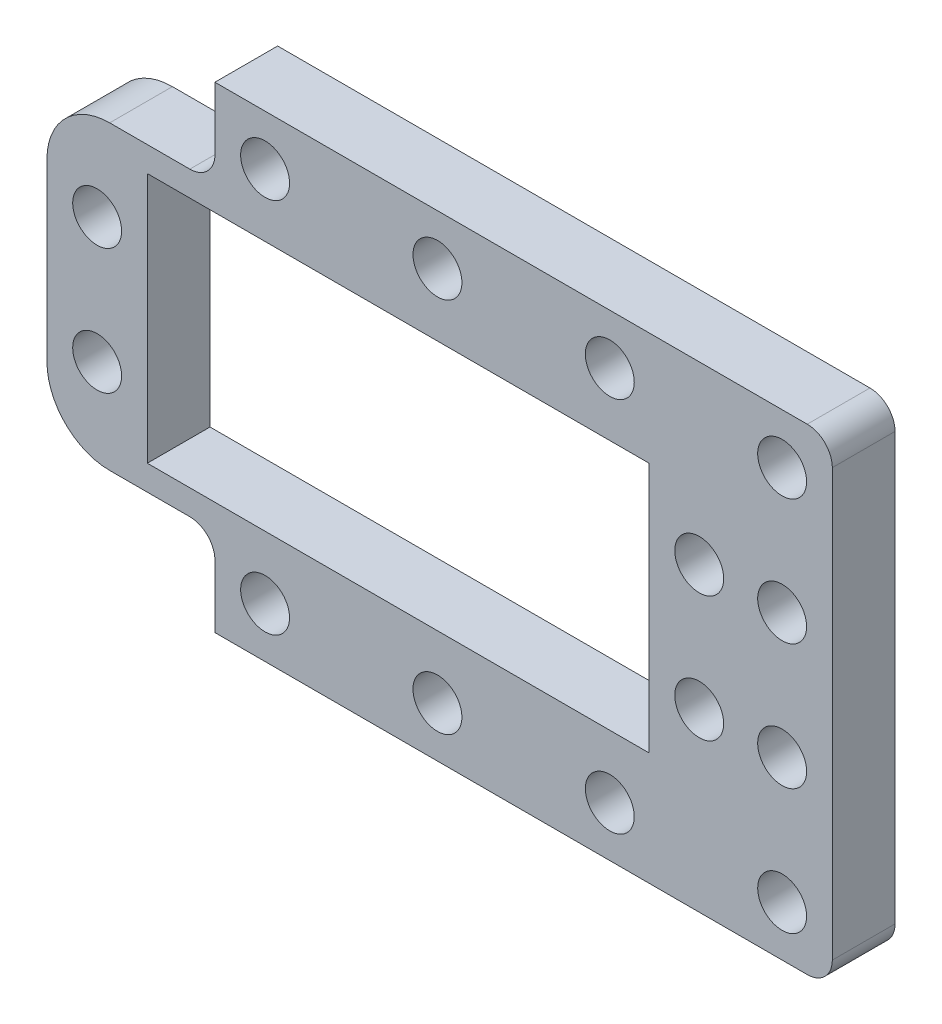
ISO-10303-21;
HEADER;
FILE_DESCRIPTION(('STEP AP214'),'2;1');
FILE_NAME('part.step','',(''),(''),'','','');
FILE_SCHEMA(('AUTOMOTIVE_DESIGN { 1 0 10303 214 1 1 1 1 }'));
ENDSEC;
DATA;
#1=APPLICATION_CONTEXT('core data for automotive mechanical design processes');
#2=APPLICATION_PROTOCOL_DEFINITION('international standard','automotive_design',2000,#1);
#3=PRODUCT_CONTEXT('',#1,'mechanical');
#4=PRODUCT('Part','Part','',(#3));
#5=PRODUCT_RELATED_PRODUCT_CATEGORY('part','',(#4));
#6=PRODUCT_DEFINITION_FORMATION('','',#4);
#7=PRODUCT_DEFINITION_CONTEXT('part definition',#1,'design');
#8=PRODUCT_DEFINITION('design','',#6,#7);
#9=PRODUCT_DEFINITION_SHAPE('','',#8);
#10=(LENGTH_UNIT() NAMED_UNIT(*) SI_UNIT(.MILLI.,.METRE.));
#11=(NAMED_UNIT(*) PLANE_ANGLE_UNIT() SI_UNIT($,.RADIAN.));
#12=(NAMED_UNIT(*) SI_UNIT($,.STERADIAN.) SOLID_ANGLE_UNIT());
#13=UNCERTAINTY_MEASURE_WITH_UNIT(LENGTH_MEASURE(1.E-05),#10,'distance_accuracy_value','');
#14=(GEOMETRIC_REPRESENTATION_CONTEXT(3) GLOBAL_UNCERTAINTY_ASSIGNED_CONTEXT((#13)) GLOBAL_UNIT_ASSIGNED_CONTEXT((#10,
#11,#12)) REPRESENTATION_CONTEXT('',''));
#15=CARTESIAN_POINT('',(0.,0.,0.));
#16=DIRECTION('',(0.,0.,1.));
#17=DIRECTION('',(1.,0.,0.));
#18=AXIS2_PLACEMENT_3D('',#15,#16,#17);
#19=CARTESIAN_POINT('',(-2.,-36.,5.));
#20=DIRECTION('',(0.,0.,1.));
#21=DIRECTION('',(1.,0.,0.));
#22=AXIS2_PLACEMENT_3D('',#19,#20,#21);
#23=PLANE('',#22);
#24=DIRECTION('',(0.,-1.,0.));
#25=VECTOR('',#24,1.);
#26=CARTESIAN_POINT('',(-62.61,-2.00000000000001,5.));
#27=LINE('',#26,#25);
#28=CARTESIAN_POINT('',(-62.61,-12.,5.));
#29=VERTEX_POINT('',#28);
#30=CARTESIAN_POINT('',(-62.61,-26.,5.));
#31=VERTEX_POINT('',#30);
#32=EDGE_CURVE('E256',#29,#31,#27,.T.);
#33=ORIENTED_EDGE('',*,*,#32,.T.);
#34=CARTESIAN_POINT('',(-57.61,-26.,5.));
#35=DIRECTION('',(0.,0.,1.));
#36=DIRECTION('',(1.,0.,0.));
#37=AXIS2_PLACEMENT_3D('',#34,#35,#36);
#38=CIRCLE('',#37,5.);
#39=CARTESIAN_POINT('',(-57.61,-31.,5.));
#40=VERTEX_POINT('',#39);
#41=EDGE_CURVE('E239',#31,#40,#38,.T.);
#42=ORIENTED_EDGE('',*,*,#41,.T.);
#43=DIRECTION('',(-1.,0.,0.));
#44=VECTOR('',#43,1.);
#45=CARTESIAN_POINT('',(-49.22,-31.,5.));
#46=LINE('',#45,#44);
#47=CARTESIAN_POINT('',(-51.22,-31.,5.));
#48=VERTEX_POINT('',#47);
#49=EDGE_CURVE('E255',#48,#40,#46,.T.);
#50=ORIENTED_EDGE('',*,*,#49,.F.);
#51=CARTESIAN_POINT('',(-51.22,-33.,5.));
#52=DIRECTION('',(0.,0.,1.));
#53=DIRECTION('',(1.,0.,0.));
#54=AXIS2_PLACEMENT_3D('',#51,#52,#53);
#55=CIRCLE('',#54,2.);
#56=CARTESIAN_POINT('',(-49.22,-33.,5.));
#57=VERTEX_POINT('',#56);
#58=EDGE_CURVE('E224',#48,#57,#55,.F.);
#59=ORIENTED_EDGE('',*,*,#58,.T.);
#60=DIRECTION('',(0.,1.,0.));
#61=VECTOR('',#60,1.);
#62=CARTESIAN_POINT('',(-49.22,-31.,5.));
#63=LINE('',#62,#61);
#64=CARTESIAN_POINT('',(-49.22,-38.,5.));
#65=VERTEX_POINT('',#64);
#66=EDGE_CURVE('E260',#65,#57,#63,.T.);
#67=ORIENTED_EDGE('',*,*,#66,.F.);
#68=DIRECTION('',(1.,0.,0.));
#69=VECTOR('',#68,1.);
#70=CARTESIAN_POINT('',(-2.,-38.,5.));
#71=LINE('',#70,#69);
#72=CARTESIAN_POINT('',(-2.,-38.,5.));
#73=VERTEX_POINT('',#72);
#74=EDGE_CURVE('E206',#65,#73,#71,.T.);
#75=ORIENTED_EDGE('',*,*,#74,.T.);
#76=CARTESIAN_POINT('',(-2.,-36.,5.));
#77=DIRECTION('',(0.,0.,1.));
#78=DIRECTION('',(1.,0.,0.));
#79=AXIS2_PLACEMENT_3D('',#76,#77,#78);
#80=CIRCLE('',#79,2.);
#81=CARTESIAN_POINT('',(0.,-36.,5.));
#82=VERTEX_POINT('',#81);
#83=EDGE_CURVE('E202',#73,#82,#80,.T.);
#84=ORIENTED_EDGE('',*,*,#83,.T.);
#85=DIRECTION('',(0.,1.,0.));
#86=VECTOR('',#85,1.);
#87=CARTESIAN_POINT('',(0.,-2.,5.));
#88=LINE('',#87,#86);
#89=CARTESIAN_POINT('',(0.,-2.,5.));
#90=VERTEX_POINT('',#89);
#91=EDGE_CURVE('E387',#82,#90,#88,.T.);
#92=ORIENTED_EDGE('',*,*,#91,.T.);
#93=CARTESIAN_POINT('',(-2.,-2.,5.));
#94=DIRECTION('',(0.,0.,1.));
#95=DIRECTION('',(-1.,0.,0.));
#96=AXIS2_PLACEMENT_3D('',#93,#94,#95);
#97=CIRCLE('',#96,2.);
#98=CARTESIAN_POINT('',(-2.,0.,5.));
#99=VERTEX_POINT('',#98);
#100=EDGE_CURVE('E389',#90,#99,#97,.T.);
#101=ORIENTED_EDGE('',*,*,#100,.T.);
#102=DIRECTION('',(-1.,0.,0.));
#103=VECTOR('',#102,1.);
#104=CARTESIAN_POINT('',(-2.,0.,5.));
#105=LINE('',#104,#103);
#106=CARTESIAN_POINT('',(-49.22,0.,5.));
#107=VERTEX_POINT('',#106);
#108=EDGE_CURVE('E391',#99,#107,#105,.T.);
#109=ORIENTED_EDGE('',*,*,#108,.T.);
#110=DIRECTION('',(0.,1.,0.));
#111=VECTOR('',#110,1.);
#112=CARTESIAN_POINT('',(-49.22,0.,5.));
#113=LINE('',#112,#111);
#114=CARTESIAN_POINT('',(-49.22,-5.,5.));
#115=VERTEX_POINT('',#114);
#116=EDGE_CURVE('E181',#115,#107,#113,.T.);
#117=ORIENTED_EDGE('',*,*,#116,.F.);
#118=CARTESIAN_POINT('',(-51.22,-5.,5.));
#119=DIRECTION('',(0.,0.,1.));
#120=DIRECTION('',(1.,0.,0.));
#121=AXIS2_PLACEMENT_3D('',#118,#119,#120);
#122=CIRCLE('',#121,2.);
#123=CARTESIAN_POINT('',(-51.22,-7.,5.));
#124=VERTEX_POINT('',#123);
#125=EDGE_CURVE('E228',#115,#124,#122,.F.);
#126=ORIENTED_EDGE('',*,*,#125,.T.);
#127=DIRECTION('',(1.,0.,0.));
#128=VECTOR('',#127,1.);
#129=CARTESIAN_POINT('',(-49.22,-7.,5.));
#130=LINE('',#129,#128);
#131=CARTESIAN_POINT('',(-57.61,-7.,5.));
#132=VERTEX_POINT('',#131);
#133=EDGE_CURVE('E175',#132,#124,#130,.T.);
#134=ORIENTED_EDGE('',*,*,#133,.F.);
#135=CARTESIAN_POINT('',(-57.61,-12.,5.));
#136=DIRECTION('',(0.,0.,1.));
#137=DIRECTION('',(1.,0.,0.));
#138=AXIS2_PLACEMENT_3D('',#135,#136,#137);
#139=CIRCLE('',#138,5.);
#140=EDGE_CURVE('E237',#132,#29,#139,.T.);
#141=ORIENTED_EDGE('',*,*,#140,.T.);
#142=EDGE_LOOP('',(#33,#42,#50,#59,#67,#75,#84,#92,#101,#109,#117,#126,#134,#141));
#143=FACE_BOUND('',#142,.T.);
#144=CARTESIAN_POINT('',(-17.74,-34.,5.));
#145=DIRECTION('',(0.,0.,1.));
#146=DIRECTION('',(-1.,0.,0.));
#147=AXIS2_PLACEMENT_3D('',#144,#145,#146);
#148=CIRCLE('',#147,1.95);
#149=CARTESIAN_POINT('',(-19.69,-34.,5.));
#150=VERTEX_POINT('',#149);
#151=EDGE_CURVE('E276',#150,#150,#148,.T.);
#152=ORIENTED_EDGE('',*,*,#151,.F.);
#153=EDGE_LOOP('',(#152));
#154=FACE_BOUND('',#153,.T.);
#155=CARTESIAN_POINT('',(-3.99999999999999,-34.,5.));
#156=DIRECTION('',(0.,0.,1.));
#157=DIRECTION('',(-1.,0.,0.));
#158=AXIS2_PLACEMENT_3D('',#155,#156,#157);
#159=CIRCLE('',#158,1.95);
#160=CARTESIAN_POINT('',(-5.94999999999999,-34.,5.));
#161=VERTEX_POINT('',#160);
#162=EDGE_CURVE('E288',#161,#161,#159,.T.);
#163=ORIENTED_EDGE('',*,*,#162,.F.);
#164=EDGE_LOOP('',(#163));
#165=FACE_BOUND('',#164,.T.);
#166=CARTESIAN_POINT('',(-4.,-14.,5.));
#167=DIRECTION('',(0.,0.,1.));
#168=DIRECTION('',(1.,0.,0.));
#169=AXIS2_PLACEMENT_3D('',#166,#167,#168);
#170=CIRCLE('',#169,1.95);
#171=CARTESIAN_POINT('',(-2.05,-14.,5.));
#172=VERTEX_POINT('',#171);
#173=EDGE_CURVE('E300',#172,#172,#170,.T.);
#174=ORIENTED_EDGE('',*,*,#173,.F.);
#175=EDGE_LOOP('',(#174));
#176=FACE_BOUND('',#175,.T.);
#177=CARTESIAN_POINT('',(-45.22,-4.00000000000001,5.));
#178=DIRECTION('',(0.,0.,1.));
#179=DIRECTION('',(1.,0.,0.));
#180=AXIS2_PLACEMENT_3D('',#177,#178,#179);
#181=CIRCLE('',#180,1.95);
#182=CARTESIAN_POINT('',(-43.27,-4.00000000000001,5.));
#183=VERTEX_POINT('',#182);
#184=EDGE_CURVE('E312',#183,#183,#181,.T.);
#185=ORIENTED_EDGE('',*,*,#184,.F.);
#186=EDGE_LOOP('',(#185));
#187=FACE_BOUND('',#186,.T.);
#188=CARTESIAN_POINT('',(-58.61,-24.,5.));
#189=DIRECTION('',(0.,0.,1.));
#190=DIRECTION('',(-1.,0.,0.));
#191=AXIS2_PLACEMENT_3D('',#188,#189,#190);
#192=CIRCLE('',#191,1.95);
#193=CARTESIAN_POINT('',(-60.56,-24.,5.));
#194=VERTEX_POINT('',#193);
#195=EDGE_CURVE('E324',#194,#194,#192,.T.);
#196=ORIENTED_EDGE('',*,*,#195,.F.);
#197=EDGE_LOOP('',(#196));
#198=FACE_BOUND('',#197,.T.);
#199=CARTESIAN_POINT('',(-10.61,-24.,5.));
#200=DIRECTION('',(0.,0.,1.));
#201=DIRECTION('',(1.,0.,0.));
#202=AXIS2_PLACEMENT_3D('',#199,#200,#201);
#203=CIRCLE('',#202,1.95);
#204=CARTESIAN_POINT('',(-8.65999999999999,-24.,5.));
#205=VERTEX_POINT('',#204);
#206=EDGE_CURVE('E336',#205,#205,#203,.T.);
#207=ORIENTED_EDGE('',*,*,#206,.F.);
#208=EDGE_LOOP('',(#207));
#209=FACE_BOUND('',#208,.T.);
#210=DIRECTION('',(1.,0.,0.));
#211=VECTOR('',#210,1.);
#212=CARTESIAN_POINT('',(-54.61,-29.,5.));
#213=LINE('',#212,#211);
#214=CARTESIAN_POINT('',(-54.61,-29.,5.));
#215=VERTEX_POINT('',#214);
#216=CARTESIAN_POINT('',(-14.61,-29.,5.));
#217=VERTEX_POINT('',#216);
#218=EDGE_CURVE('E350',#215,#217,#213,.T.);
#219=ORIENTED_EDGE('',*,*,#218,.F.);
#220=DIRECTION('',(0.,-1.,0.));
#221=VECTOR('',#220,1.);
#222=CARTESIAN_POINT('',(-54.61,-9.,5.));
#223=LINE('',#222,#221);
#224=CARTESIAN_POINT('',(-54.61,-9.,5.));
#225=VERTEX_POINT('',#224);
#226=EDGE_CURVE('E348',#225,#215,#223,.T.);
#227=ORIENTED_EDGE('',*,*,#226,.F.);
#228=DIRECTION('',(-1.,0.,0.));
#229=VECTOR('',#228,1.);
#230=CARTESIAN_POINT('',(-54.61,-9.,5.));
#231=LINE('',#230,#229);
#232=CARTESIAN_POINT('',(-14.61,-9.,5.));
#233=VERTEX_POINT('',#232);
#234=EDGE_CURVE('E356',#233,#225,#231,.T.);
#235=ORIENTED_EDGE('',*,*,#234,.F.);
#236=DIRECTION('',(0.,1.,0.));
#237=VECTOR('',#236,1.);
#238=CARTESIAN_POINT('',(-14.61,-9.,5.));
#239=LINE('',#238,#237);
#240=EDGE_CURVE('E353',#217,#233,#239,.T.);
#241=ORIENTED_EDGE('',*,*,#240,.F.);
#242=EDGE_LOOP('',(#219,#227,#235,#241));
#243=FACE_BOUND('',#242,.T.);
#244=CARTESIAN_POINT('',(-4.,-24.,5.));
#245=DIRECTION('',(0.,0.,1.));
#246=DIRECTION('',(1.,0.,0.));
#247=AXIS2_PLACEMENT_3D('',#244,#245,#246);
#248=CIRCLE('',#247,1.95);
#249=CARTESIAN_POINT('',(-2.05,-24.,5.));
#250=VERTEX_POINT('',#249);
#251=EDGE_CURVE('E379',#250,#250,#248,.T.);
#252=ORIENTED_EDGE('',*,*,#251,.F.);
#253=EDGE_LOOP('',(#252));
#254=FACE_BOUND('',#253,.T.);
#255=CARTESIAN_POINT('',(-45.22,-34.,5.));
#256=DIRECTION('',(0.,0.,1.));
#257=DIRECTION('',(-1.,0.,0.));
#258=AXIS2_PLACEMENT_3D('',#255,#256,#257);
#259=CIRCLE('',#258,1.95);
#260=CARTESIAN_POINT('',(-47.17,-34.,5.));
#261=VERTEX_POINT('',#260);
#262=EDGE_CURVE('E342',#261,#261,#259,.T.);
#263=ORIENTED_EDGE('',*,*,#262,.F.);
#264=EDGE_LOOP('',(#263));
#265=FACE_BOUND('',#264,.T.);
#266=CARTESIAN_POINT('',(-10.61,-14.,5.));
#267=DIRECTION('',(0.,0.,1.));
#268=DIRECTION('',(1.,0.,0.));
#269=AXIS2_PLACEMENT_3D('',#266,#267,#268);
#270=CIRCLE('',#269,1.95);
#271=CARTESIAN_POINT('',(-8.65999999999999,-14.,5.));
#272=VERTEX_POINT('',#271);
#273=EDGE_CURVE('E330',#272,#272,#270,.T.);
#274=ORIENTED_EDGE('',*,*,#273,.F.);
#275=EDGE_LOOP('',(#274));
#276=FACE_BOUND('',#275,.T.);
#277=CARTESIAN_POINT('',(-58.61,-14.,5.));
#278=DIRECTION('',(0.,0.,1.));
#279=DIRECTION('',(-1.,0.,0.));
#280=AXIS2_PLACEMENT_3D('',#277,#278,#279);
#281=CIRCLE('',#280,1.95);
#282=CARTESIAN_POINT('',(-60.56,-14.,5.));
#283=VERTEX_POINT('',#282);
#284=EDGE_CURVE('E318',#283,#283,#281,.T.);
#285=ORIENTED_EDGE('',*,*,#284,.F.);
#286=EDGE_LOOP('',(#285));
#287=FACE_BOUND('',#286,.T.);
#288=CARTESIAN_POINT('',(-4.,-4.00000000000001,5.));
#289=DIRECTION('',(0.,0.,1.));
#290=DIRECTION('',(1.,0.,0.));
#291=AXIS2_PLACEMENT_3D('',#288,#289,#290);
#292=CIRCLE('',#291,1.95);
#293=CARTESIAN_POINT('',(-2.05,-4.00000000000001,5.));
#294=VERTEX_POINT('',#293);
#295=EDGE_CURVE('E306',#294,#294,#292,.T.);
#296=ORIENTED_EDGE('',*,*,#295,.F.);
#297=EDGE_LOOP('',(#296));
#298=FACE_BOUND('',#297,.T.);
#299=CARTESIAN_POINT('',(-31.48,-4.00000000000001,5.));
#300=DIRECTION('',(0.,0.,1.));
#301=DIRECTION('',(1.,0.,0.));
#302=AXIS2_PLACEMENT_3D('',#299,#300,#301);
#303=CIRCLE('',#302,1.95);
#304=CARTESIAN_POINT('',(-29.53,-4.00000000000001,5.));
#305=VERTEX_POINT('',#304);
#306=EDGE_CURVE('E294',#305,#305,#303,.T.);
#307=ORIENTED_EDGE('',*,*,#306,.F.);
#308=EDGE_LOOP('',(#307));
#309=FACE_BOUND('',#308,.T.);
#310=CARTESIAN_POINT('',(-17.74,-4.00000000000001,5.));
#311=DIRECTION('',(0.,0.,1.));
#312=DIRECTION('',(1.,0.,0.));
#313=AXIS2_PLACEMENT_3D('',#310,#311,#312);
#314=CIRCLE('',#313,1.95);
#315=CARTESIAN_POINT('',(-15.79,-4.00000000000001,5.));
#316=VERTEX_POINT('',#315);
#317=EDGE_CURVE('E282',#316,#316,#314,.T.);
#318=ORIENTED_EDGE('',*,*,#317,.F.);
#319=EDGE_LOOP('',(#318));
#320=FACE_BOUND('',#319,.T.);
#321=CARTESIAN_POINT('',(-31.48,-34.,5.));
#322=DIRECTION('',(0.,0.,1.));
#323=DIRECTION('',(-1.,0.,0.));
#324=AXIS2_PLACEMENT_3D('',#321,#322,#323);
#325=CIRCLE('',#324,1.95);
#326=CARTESIAN_POINT('',(-33.43,-34.,5.));
#327=VERTEX_POINT('',#326);
#328=EDGE_CURVE('E270',#327,#327,#325,.T.);
#329=ORIENTED_EDGE('',*,*,#328,.F.);
#330=EDGE_LOOP('',(#329));
#331=FACE_BOUND('',#330,.T.);
#332=ADVANCED_FACE('F35',(#143,#154,#165,#176,#187,#198,#209,#243,#254,#265,#276,#287,#298,#309,
#320,#331),#23,.T.);
#333=CARTESIAN_POINT('',(-2.,-36.,0.));
#334=DIRECTION('',(0.,0.,1.));
#335=DIRECTION('',(1.,0.,0.));
#336=AXIS2_PLACEMENT_3D('',#333,#334,#335);
#337=PLANE('',#336);
#338=CARTESIAN_POINT('',(-4.,-24.,0.));
#339=DIRECTION('',(0.,0.,1.));
#340=DIRECTION('',(1.,0.,0.));
#341=AXIS2_PLACEMENT_3D('',#338,#339,#340);
#342=CIRCLE('',#341,1.95);
#343=CARTESIAN_POINT('',(-2.05,-24.,0.));
#344=VERTEX_POINT('',#343);
#345=EDGE_CURVE('E378',#344,#344,#342,.T.);
#346=ORIENTED_EDGE('',*,*,#345,.T.);
#347=EDGE_LOOP('',(#346));
#348=FACE_BOUND('',#347,.T.);
#349=DIRECTION('',(-1.,0.,0.));
#350=VECTOR('',#349,1.);
#351=CARTESIAN_POINT('',(-49.22,-31.,0.));
#352=LINE('',#351,#350);
#353=CARTESIAN_POINT('',(-51.22,-31.,0.));
#354=VERTEX_POINT('',#353);
#355=CARTESIAN_POINT('',(-57.61,-31.,0.));
#356=VERTEX_POINT('',#355);
#357=EDGE_CURVE('E243',#354,#356,#352,.T.);
#358=ORIENTED_EDGE('',*,*,#357,.T.);
#359=CARTESIAN_POINT('',(-57.61,-26.,0.));
#360=DIRECTION('',(0.,0.,1.));
#361=DIRECTION('',(1.,0.,0.));
#362=AXIS2_PLACEMENT_3D('',#359,#360,#361);
#363=CIRCLE('',#362,5.);
#364=CARTESIAN_POINT('',(-62.61,-26.,0.));
#365=VERTEX_POINT('',#364);
#366=EDGE_CURVE('E43',#356,#365,#363,.F.);
#367=ORIENTED_EDGE('',*,*,#366,.T.);
#368=DIRECTION('',(0.,-1.,0.));
#369=VECTOR('',#368,1.);
#370=CARTESIAN_POINT('',(-62.61,-2.00000000000001,0.));
#371=LINE('',#370,#369);
#372=CARTESIAN_POINT('',(-62.61,-12.,0.));
#373=VERTEX_POINT('',#372);
#374=EDGE_CURVE('E191',#373,#365,#371,.T.);
#375=ORIENTED_EDGE('',*,*,#374,.F.);
#376=CARTESIAN_POINT('',(-57.61,-12.,0.));
#377=DIRECTION('',(0.,0.,1.));
#378=DIRECTION('',(1.,0.,0.));
#379=AXIS2_PLACEMENT_3D('',#376,#377,#378);
#380=CIRCLE('',#379,5.);
#381=CARTESIAN_POINT('',(-57.61,-7.,0.));
#382=VERTEX_POINT('',#381);
#383=EDGE_CURVE('E50',#373,#382,#380,.F.);
#384=ORIENTED_EDGE('',*,*,#383,.T.);
#385=DIRECTION('',(1.,0.,0.));
#386=VECTOR('',#385,1.);
#387=CARTESIAN_POINT('',(-49.22,-7.,0.));
#388=LINE('',#387,#386);
#389=CARTESIAN_POINT('',(-51.22,-7.,0.));
#390=VERTEX_POINT('',#389);
#391=EDGE_CURVE('E174',#382,#390,#388,.T.);
#392=ORIENTED_EDGE('',*,*,#391,.T.);
#393=CARTESIAN_POINT('',(-51.22,-5.,0.));
#394=DIRECTION('',(0.,0.,1.));
#395=DIRECTION('',(1.,0.,0.));
#396=AXIS2_PLACEMENT_3D('',#393,#394,#395);
#397=CIRCLE('',#396,2.);
#398=CARTESIAN_POINT('',(-49.22,-5.,0.));
#399=VERTEX_POINT('',#398);
#400=EDGE_CURVE('E170',#390,#399,#397,.T.);
#401=ORIENTED_EDGE('',*,*,#400,.T.);
#402=DIRECTION('',(0.,1.,0.));
#403=VECTOR('',#402,1.);
#404=CARTESIAN_POINT('',(-49.22,0.,0.));
#405=LINE('',#404,#403);
#406=CARTESIAN_POINT('',(-49.22,0.,0.));
#407=VERTEX_POINT('',#406);
#408=EDGE_CURVE('E162',#399,#407,#405,.T.);
#409=ORIENTED_EDGE('',*,*,#408,.T.);
#410=DIRECTION('',(-1.,0.,0.));
#411=VECTOR('',#410,1.);
#412=CARTESIAN_POINT('',(-2.,0.,0.));
#413=LINE('',#412,#411);
#414=CARTESIAN_POINT('',(-2.,0.,0.));
#415=VERTEX_POINT('',#414);
#416=EDGE_CURVE('E168',#415,#407,#413,.T.);
#417=ORIENTED_EDGE('',*,*,#416,.F.);
#418=CARTESIAN_POINT('',(-2.,-2.,0.));
#419=DIRECTION('',(0.,0.,1.));
#420=DIRECTION('',(-1.,0.,0.));
#421=AXIS2_PLACEMENT_3D('',#418,#419,#420);
#422=CIRCLE('',#421,2.);
#423=CARTESIAN_POINT('',(0.,-2.,0.));
#424=VERTEX_POINT('',#423);
#425=EDGE_CURVE('E192',#424,#415,#422,.T.);
#426=ORIENTED_EDGE('',*,*,#425,.F.);
#427=DIRECTION('',(0.,1.,0.));
#428=VECTOR('',#427,1.);
#429=CARTESIAN_POINT('',(0.,-2.,0.));
#430=LINE('',#429,#428);
#431=CARTESIAN_POINT('',(0.,-36.,0.));
#432=VERTEX_POINT('',#431);
#433=EDGE_CURVE('E197',#432,#424,#430,.T.);
#434=ORIENTED_EDGE('',*,*,#433,.F.);
#435=CARTESIAN_POINT('',(-2.,-36.,0.));
#436=DIRECTION('',(0.,0.,1.));
#437=DIRECTION('',(1.,0.,0.));
#438=AXIS2_PLACEMENT_3D('',#435,#436,#437);
#439=CIRCLE('',#438,2.);
#440=CARTESIAN_POINT('',(-2.,-38.,0.));
#441=VERTEX_POINT('',#440);
#442=EDGE_CURVE('E382',#441,#432,#439,.T.);
#443=ORIENTED_EDGE('',*,*,#442,.F.);
#444=DIRECTION('',(1.,0.,0.));
#445=VECTOR('',#444,1.);
#446=CARTESIAN_POINT('',(-2.,-38.,0.));
#447=LINE('',#446,#445);
#448=CARTESIAN_POINT('',(-49.22,-38.,0.));
#449=VERTEX_POINT('',#448);
#450=EDGE_CURVE('E195',#449,#441,#447,.T.);
#451=ORIENTED_EDGE('',*,*,#450,.F.);
#452=DIRECTION('',(0.,1.,0.));
#453=VECTOR('',#452,1.);
#454=CARTESIAN_POINT('',(-49.22,-31.,0.));
#455=LINE('',#454,#453);
#456=CARTESIAN_POINT('',(-49.22,-33.,0.));
#457=VERTEX_POINT('',#456);
#458=EDGE_CURVE('E259',#449,#457,#455,.T.);
#459=ORIENTED_EDGE('',*,*,#458,.T.);
#460=CARTESIAN_POINT('',(-51.22,-33.,0.));
#461=DIRECTION('',(0.,0.,1.));
#462=DIRECTION('',(1.,0.,0.));
#463=AXIS2_PLACEMENT_3D('',#460,#461,#462);
#464=CIRCLE('',#463,2.);
#465=EDGE_CURVE('E226',#457,#354,#464,.T.);
#466=ORIENTED_EDGE('',*,*,#465,.T.);
#467=EDGE_LOOP('',(#358,#367,#375,#384,#392,#401,#409,#417,#426,#434,#443,#451,#459,#466));
#468=FACE_BOUND('',#467,.T.);
#469=DIRECTION('',(0.,-1.,0.));
#470=VECTOR('',#469,1.);
#471=CARTESIAN_POINT('',(-54.61,-9.,0.));
#472=LINE('',#471,#470);
#473=CARTESIAN_POINT('',(-54.61,-9.,0.));
#474=VERTEX_POINT('',#473);
#475=CARTESIAN_POINT('',(-54.61,-29.,0.));
#476=VERTEX_POINT('',#475);
#477=EDGE_CURVE('E345',#474,#476,#472,.T.);
#478=ORIENTED_EDGE('',*,*,#477,.T.);
#479=DIRECTION('',(1.,0.,0.));
#480=VECTOR('',#479,1.);
#481=CARTESIAN_POINT('',(-54.61,-29.,0.));
#482=LINE('',#481,#480);
#483=CARTESIAN_POINT('',(-14.61,-29.,0.));
#484=VERTEX_POINT('',#483);
#485=EDGE_CURVE('E361',#476,#484,#482,.T.);
#486=ORIENTED_EDGE('',*,*,#485,.T.);
#487=DIRECTION('',(0.,1.,0.));
#488=VECTOR('',#487,1.);
#489=CARTESIAN_POINT('',(-14.61,-9.,0.));
#490=LINE('',#489,#488);
#491=CARTESIAN_POINT('',(-14.61,-9.,0.));
#492=VERTEX_POINT('',#491);
#493=EDGE_CURVE('E364',#484,#492,#490,.T.);
#494=ORIENTED_EDGE('',*,*,#493,.T.);
#495=DIRECTION('',(-1.,0.,0.));
#496=VECTOR('',#495,1.);
#497=CARTESIAN_POINT('',(-54.61,-9.,0.));
#498=LINE('',#497,#496);
#499=EDGE_CURVE('E351',#492,#474,#498,.T.);
#500=ORIENTED_EDGE('',*,*,#499,.T.);
#501=EDGE_LOOP('',(#478,#486,#494,#500));
#502=FACE_BOUND('',#501,.T.);
#503=CARTESIAN_POINT('',(-45.22,-34.,0.));
#504=DIRECTION('',(0.,0.,1.));
#505=DIRECTION('',(-1.,0.,0.));
#506=AXIS2_PLACEMENT_3D('',#503,#504,#505);
#507=CIRCLE('',#506,1.95);
#508=CARTESIAN_POINT('',(-47.17,-34.,0.));
#509=VERTEX_POINT('',#508);
#510=EDGE_CURVE('E339',#509,#509,#507,.T.);
#511=ORIENTED_EDGE('',*,*,#510,.T.);
#512=EDGE_LOOP('',(#511));
#513=FACE_BOUND('',#512,.T.);
#514=CARTESIAN_POINT('',(-10.61,-24.,0.));
#515=DIRECTION('',(0.,0.,1.));
#516=DIRECTION('',(1.,0.,0.));
#517=AXIS2_PLACEMENT_3D('',#514,#515,#516);
#518=CIRCLE('',#517,1.95);
#519=CARTESIAN_POINT('',(-8.65999999999999,-24.,0.));
#520=VERTEX_POINT('',#519);
#521=EDGE_CURVE('E333',#520,#520,#518,.T.);
#522=ORIENTED_EDGE('',*,*,#521,.T.);
#523=EDGE_LOOP('',(#522));
#524=FACE_BOUND('',#523,.T.);
#525=CARTESIAN_POINT('',(-10.61,-14.,0.));
#526=DIRECTION('',(0.,0.,1.));
#527=DIRECTION('',(1.,0.,0.));
#528=AXIS2_PLACEMENT_3D('',#525,#526,#527);
#529=CIRCLE('',#528,1.95);
#530=CARTESIAN_POINT('',(-8.65999999999999,-14.,0.));
#531=VERTEX_POINT('',#530);
#532=EDGE_CURVE('E327',#531,#531,#529,.T.);
#533=ORIENTED_EDGE('',*,*,#532,.T.);
#534=EDGE_LOOP('',(#533));
#535=FACE_BOUND('',#534,.T.);
#536=CARTESIAN_POINT('',(-58.61,-24.,0.));
#537=DIRECTION('',(0.,0.,1.));
#538=DIRECTION('',(-1.,0.,0.));
#539=AXIS2_PLACEMENT_3D('',#536,#537,#538);
#540=CIRCLE('',#539,1.95);
#541=CARTESIAN_POINT('',(-60.56,-24.,0.));
#542=VERTEX_POINT('',#541);
#543=EDGE_CURVE('E321',#542,#542,#540,.T.);
#544=ORIENTED_EDGE('',*,*,#543,.T.);
#545=EDGE_LOOP('',(#544));
#546=FACE_BOUND('',#545,.T.);
#547=CARTESIAN_POINT('',(-58.61,-14.,0.));
#548=DIRECTION('',(0.,0.,1.));
#549=DIRECTION('',(-1.,0.,0.));
#550=AXIS2_PLACEMENT_3D('',#547,#548,#549);
#551=CIRCLE('',#550,1.95);
#552=CARTESIAN_POINT('',(-60.56,-14.,0.));
#553=VERTEX_POINT('',#552);
#554=EDGE_CURVE('E315',#553,#553,#551,.T.);
#555=ORIENTED_EDGE('',*,*,#554,.T.);
#556=EDGE_LOOP('',(#555));
#557=FACE_BOUND('',#556,.T.);
#558=CARTESIAN_POINT('',(-45.22,-4.00000000000001,0.));
#559=DIRECTION('',(0.,0.,1.));
#560=DIRECTION('',(1.,0.,0.));
#561=AXIS2_PLACEMENT_3D('',#558,#559,#560);
#562=CIRCLE('',#561,1.95);
#563=CARTESIAN_POINT('',(-43.27,-4.00000000000001,0.));
#564=VERTEX_POINT('',#563);
#565=EDGE_CURVE('E309',#564,#564,#562,.T.);
#566=ORIENTED_EDGE('',*,*,#565,.T.);
#567=EDGE_LOOP('',(#566));
#568=FACE_BOUND('',#567,.T.);
#569=CARTESIAN_POINT('',(-4.,-4.00000000000001,0.));
#570=DIRECTION('',(0.,0.,1.));
#571=DIRECTION('',(1.,0.,0.));
#572=AXIS2_PLACEMENT_3D('',#569,#570,#571);
#573=CIRCLE('',#572,1.95);
#574=CARTESIAN_POINT('',(-2.05,-4.00000000000001,0.));
#575=VERTEX_POINT('',#574);
#576=EDGE_CURVE('E303',#575,#575,#573,.T.);
#577=ORIENTED_EDGE('',*,*,#576,.T.);
#578=EDGE_LOOP('',(#577));
#579=FACE_BOUND('',#578,.T.);
#580=CARTESIAN_POINT('',(-4.,-14.,0.));
#581=DIRECTION('',(0.,0.,1.));
#582=DIRECTION('',(1.,0.,0.));
#583=AXIS2_PLACEMENT_3D('',#580,#581,#582);
#584=CIRCLE('',#583,1.95);
#585=CARTESIAN_POINT('',(-2.05,-14.,0.));
#586=VERTEX_POINT('',#585);
#587=EDGE_CURVE('E297',#586,#586,#584,.T.);
#588=ORIENTED_EDGE('',*,*,#587,.T.);
#589=EDGE_LOOP('',(#588));
#590=FACE_BOUND('',#589,.T.);
#591=CARTESIAN_POINT('',(-31.48,-4.00000000000001,0.));
#592=DIRECTION('',(0.,0.,1.));
#593=DIRECTION('',(1.,0.,0.));
#594=AXIS2_PLACEMENT_3D('',#591,#592,#593);
#595=CIRCLE('',#594,1.95);
#596=CARTESIAN_POINT('',(-29.53,-4.00000000000001,0.));
#597=VERTEX_POINT('',#596);
#598=EDGE_CURVE('E291',#597,#597,#595,.T.);
#599=ORIENTED_EDGE('',*,*,#598,.T.);
#600=EDGE_LOOP('',(#599));
#601=FACE_BOUND('',#600,.T.);
#602=CARTESIAN_POINT('',(-3.99999999999999,-34.,0.));
#603=DIRECTION('',(0.,0.,1.));
#604=DIRECTION('',(-1.,0.,0.));
#605=AXIS2_PLACEMENT_3D('',#602,#603,#604);
#606=CIRCLE('',#605,1.95);
#607=CARTESIAN_POINT('',(-5.94999999999999,-34.,0.));
#608=VERTEX_POINT('',#607);
#609=EDGE_CURVE('E285',#608,#608,#606,.T.);
#610=ORIENTED_EDGE('',*,*,#609,.T.);
#611=EDGE_LOOP('',(#610));
#612=FACE_BOUND('',#611,.T.);
#613=CARTESIAN_POINT('',(-17.74,-4.00000000000001,0.));
#614=DIRECTION('',(0.,0.,1.));
#615=DIRECTION('',(1.,0.,0.));
#616=AXIS2_PLACEMENT_3D('',#613,#614,#615);
#617=CIRCLE('',#616,1.95);
#618=CARTESIAN_POINT('',(-15.79,-4.00000000000001,0.));
#619=VERTEX_POINT('',#618);
#620=EDGE_CURVE('E279',#619,#619,#617,.T.);
#621=ORIENTED_EDGE('',*,*,#620,.T.);
#622=EDGE_LOOP('',(#621));
#623=FACE_BOUND('',#622,.T.);
#624=CARTESIAN_POINT('',(-17.74,-34.,0.));
#625=DIRECTION('',(0.,0.,1.));
#626=DIRECTION('',(-1.,0.,0.));
#627=AXIS2_PLACEMENT_3D('',#624,#625,#626);
#628=CIRCLE('',#627,1.95);
#629=CARTESIAN_POINT('',(-19.69,-34.,0.));
#630=VERTEX_POINT('',#629);
#631=EDGE_CURVE('E273',#630,#630,#628,.T.);
#632=ORIENTED_EDGE('',*,*,#631,.T.);
#633=EDGE_LOOP('',(#632));
#634=FACE_BOUND('',#633,.T.);
#635=CARTESIAN_POINT('',(-31.48,-34.,0.));
#636=DIRECTION('',(0.,0.,1.));
#637=DIRECTION('',(-1.,0.,0.));
#638=AXIS2_PLACEMENT_3D('',#635,#636,#637);
#639=CIRCLE('',#638,1.95);
#640=CARTESIAN_POINT('',(-33.43,-34.,0.));
#641=VERTEX_POINT('',#640);
#642=EDGE_CURVE('E185',#641,#641,#639,.T.);
#643=ORIENTED_EDGE('',*,*,#642,.T.);
#644=EDGE_LOOP('',(#643));
#645=FACE_BOUND('',#644,.T.);
#646=ADVANCED_FACE('F164',(#348,#468,#502,#513,#524,#535,#546,#557,#568,#579,#590,#601,#612,
#623,#634,#645),#337,.F.);
#647=CARTESIAN_POINT('',(-2.,-36.,5.));
#648=DIRECTION('',(0.,0.,-1.));
#649=DIRECTION('',(-1.,0.,0.));
#650=AXIS2_PLACEMENT_3D('',#647,#648,#649);
#651=CYLINDRICAL_SURFACE('',#650,2.);
#652=ORIENTED_EDGE('',*,*,#442,.T.);
#653=DIRECTION('',(0.,0.,-1.));
#654=VECTOR('',#653,1.);
#655=CARTESIAN_POINT('',(0.,-36.,5.));
#656=LINE('',#655,#654);
#657=EDGE_CURVE('E211',#82,#432,#656,.T.);
#658=ORIENTED_EDGE('',*,*,#657,.F.);
#659=ORIENTED_EDGE('',*,*,#83,.F.);
#660=DIRECTION('',(0.,0.,-1.));
#661=VECTOR('',#660,1.);
#662=CARTESIAN_POINT('',(-2.,-38.,5.));
#663=LINE('',#662,#661);
#664=EDGE_CURVE('E203',#73,#441,#663,.T.);
#665=ORIENTED_EDGE('',*,*,#664,.T.);
#666=EDGE_LOOP('',(#652,#658,#659,#665));
#667=FACE_BOUND('',#666,.T.);
#668=ADVANCED_FACE('F409',(#667),#651,.T.);
#669=CARTESIAN_POINT('',(0.,-2.,5.));
#670=DIRECTION('',(-1.,0.,0.));
#671=DIRECTION('',(0.,-1.,0.));
#672=AXIS2_PLACEMENT_3D('',#669,#670,#671);
#673=PLANE('',#672);
#674=ORIENTED_EDGE('',*,*,#433,.T.);
#675=DIRECTION('',(0.,0.,-1.));
#676=VECTOR('',#675,1.);
#677=CARTESIAN_POINT('',(0.,-2.,5.));
#678=LINE('',#677,#676);
#679=EDGE_CURVE('E208',#90,#424,#678,.T.);
#680=ORIENTED_EDGE('',*,*,#679,.F.);
#681=ORIENTED_EDGE('',*,*,#91,.F.);
#682=ORIENTED_EDGE('',*,*,#657,.T.);
#683=EDGE_LOOP('',(#674,#680,#681,#682));
#684=FACE_BOUND('',#683,.T.);
#685=ADVANCED_FACE('F398',(#684),#673,.F.);
#686=CARTESIAN_POINT('',(-2.,-2.,5.));
#687=DIRECTION('',(0.,0.,-1.));
#688=DIRECTION('',(-1.,0.,0.));
#689=AXIS2_PLACEMENT_3D('',#686,#687,#688);
#690=CYLINDRICAL_SURFACE('',#689,2.);
#691=ORIENTED_EDGE('',*,*,#425,.T.);
#692=DIRECTION('',(0.,0.,-1.));
#693=VECTOR('',#692,1.);
#694=CARTESIAN_POINT('',(-2.,0.,5.));
#695=LINE('',#694,#693);
#696=EDGE_CURVE('E190',#99,#415,#695,.T.);
#697=ORIENTED_EDGE('',*,*,#696,.F.);
#698=ORIENTED_EDGE('',*,*,#100,.F.);
#699=ORIENTED_EDGE('',*,*,#679,.T.);
#700=EDGE_LOOP('',(#691,#697,#698,#699));
#701=FACE_BOUND('',#700,.T.);
#702=ADVANCED_FACE('F403',(#701),#690,.T.);
#703=CARTESIAN_POINT('',(-2.,0.,5.));
#704=DIRECTION('',(0.,-1.,0.));
#705=DIRECTION('',(1.,0.,0.));
#706=AXIS2_PLACEMENT_3D('',#703,#704,#705);
#707=PLANE('',#706);
#708=ORIENTED_EDGE('',*,*,#416,.T.);
#709=DIRECTION('',(0.,0.,1.));
#710=VECTOR('',#709,1.);
#711=CARTESIAN_POINT('',(-49.22,0.,0.));
#712=LINE('',#711,#710);
#713=EDGE_CURVE('E178',#407,#107,#712,.T.);
#714=ORIENTED_EDGE('',*,*,#713,.T.);
#715=ORIENTED_EDGE('',*,*,#108,.F.);
#716=ORIENTED_EDGE('',*,*,#696,.T.);
#717=EDGE_LOOP('',(#708,#714,#715,#716));
#718=FACE_BOUND('',#717,.T.);
#719=ADVANCED_FACE('F188',(#718),#707,.F.);
#720=CARTESIAN_POINT('',(-62.61,-2.00000000000001,5.));
#721=DIRECTION('',(1.,0.,0.));
#722=DIRECTION('',(0.,1.,0.));
#723=AXIS2_PLACEMENT_3D('',#720,#721,#722);
#724=PLANE('',#723);
#725=ORIENTED_EDGE('',*,*,#374,.T.);
#726=DIRECTION('',(0.,0.,1.));
#727=VECTOR('',#726,1.);
#728=CARTESIAN_POINT('',(-62.61,-26.,5.));
#729=LINE('',#728,#727);
#730=EDGE_CURVE('E234',#365,#31,#729,.T.);
#731=ORIENTED_EDGE('',*,*,#730,.T.);
#732=ORIENTED_EDGE('',*,*,#32,.F.);
#733=DIRECTION('',(0.,0.,1.));
#734=VECTOR('',#733,1.);
#735=CARTESIAN_POINT('',(-62.61,-12.,5.));
#736=LINE('',#735,#734);
#737=EDGE_CURVE('E232',#29,#373,#736,.F.);
#738=ORIENTED_EDGE('',*,*,#737,.T.);
#739=EDGE_LOOP('',(#725,#731,#732,#738));
#740=FACE_BOUND('',#739,.T.);
#741=ADVANCED_FACE('F247',(#740),#724,.F.);
#742=CARTESIAN_POINT('',(-2.,-38.,5.));
#743=DIRECTION('',(0.,1.,0.));
#744=DIRECTION('',(-1.,0.,0.));
#745=AXIS2_PLACEMENT_3D('',#742,#743,#744);
#746=PLANE('',#745);
#747=ORIENTED_EDGE('',*,*,#74,.F.);
#748=DIRECTION('',(0.,0.,1.));
#749=VECTOR('',#748,1.);
#750=CARTESIAN_POINT('',(-49.22,-38.,0.));
#751=LINE('',#750,#749);
#752=EDGE_CURVE('E268',#449,#65,#751,.T.);
#753=ORIENTED_EDGE('',*,*,#752,.F.);
#754=ORIENTED_EDGE('',*,*,#450,.T.);
#755=ORIENTED_EDGE('',*,*,#664,.F.);
#756=EDGE_LOOP('',(#747,#753,#754,#755));
#757=FACE_BOUND('',#756,.T.);
#758=ADVANCED_FACE('F414',(#757),#746,.F.);
#759=CARTESIAN_POINT('',(-4.,-24.,5.));
#760=DIRECTION('',(0.,0.,-1.));
#761=DIRECTION('',(-1.,0.,0.));
#762=AXIS2_PLACEMENT_3D('',#759,#760,#761);
#763=CYLINDRICAL_SURFACE('',#762,1.95);
#764=ORIENTED_EDGE('',*,*,#251,.T.);
#765=EDGE_LOOP('',(#764));
#766=FACE_BOUND('',#765,.T.);
#767=ORIENTED_EDGE('',*,*,#345,.F.);
#768=EDGE_LOOP('',(#767));
#769=FACE_BOUND('',#768,.T.);
#770=ADVANCED_FACE('F443',(#766,#769),#763,.F.);
#771=CARTESIAN_POINT('',(-54.61,-9.,5.));
#772=DIRECTION('',(1.,0.,0.));
#773=DIRECTION('',(0.,0.,-1.));
#774=AXIS2_PLACEMENT_3D('',#771,#772,#773);
#775=PLANE('',#774);
#776=ORIENTED_EDGE('',*,*,#477,.F.);
#777=DIRECTION('',(0.,0.,-1.));
#778=VECTOR('',#777,1.);
#779=CARTESIAN_POINT('',(-54.61,-9.,5.));
#780=LINE('',#779,#778);
#781=EDGE_CURVE('E358',#225,#474,#780,.T.);
#782=ORIENTED_EDGE('',*,*,#781,.F.);
#783=ORIENTED_EDGE('',*,*,#226,.T.);
#784=DIRECTION('',(0.,0.,-1.));
#785=VECTOR('',#784,1.);
#786=CARTESIAN_POINT('',(-54.61,-29.,5.));
#787=LINE('',#786,#785);
#788=EDGE_CURVE('E375',#215,#476,#787,.T.);
#789=ORIENTED_EDGE('',*,*,#788,.T.);
#790=EDGE_LOOP('',(#776,#782,#783,#789));
#791=FACE_BOUND('',#790,.T.);
#792=ADVANCED_FACE('F625',(#791),#775,.T.);
#793=CARTESIAN_POINT('',(-54.61,-29.,5.));
#794=DIRECTION('',(0.,1.,0.));
#795=DIRECTION('',(-1.,0.,0.));
#796=AXIS2_PLACEMENT_3D('',#793,#794,#795);
#797=PLANE('',#796);
#798=ORIENTED_EDGE('',*,*,#485,.F.);
#799=ORIENTED_EDGE('',*,*,#788,.F.);
#800=ORIENTED_EDGE('',*,*,#218,.T.);
#801=DIRECTION('',(0.,0.,-1.));
#802=VECTOR('',#801,1.);
#803=CARTESIAN_POINT('',(-14.61,-29.,5.));
#804=LINE('',#803,#802);
#805=EDGE_CURVE('E373',#217,#484,#804,.T.);
#806=ORIENTED_EDGE('',*,*,#805,.T.);
#807=EDGE_LOOP('',(#798,#799,#800,#806));
#808=FACE_BOUND('',#807,.T.);
#809=ADVANCED_FACE('F622',(#808),#797,.T.);
#810=CARTESIAN_POINT('',(-14.61,-9.,5.));
#811=DIRECTION('',(-1.,0.,0.));
#812=DIRECTION('',(0.,-1.,0.));
#813=AXIS2_PLACEMENT_3D('',#810,#811,#812);
#814=PLANE('',#813);
#815=ORIENTED_EDGE('',*,*,#493,.F.);
#816=ORIENTED_EDGE('',*,*,#805,.F.);
#817=ORIENTED_EDGE('',*,*,#240,.T.);
#818=DIRECTION('',(0.,0.,-1.));
#819=VECTOR('',#818,1.);
#820=CARTESIAN_POINT('',(-14.61,-9.,5.));
#821=LINE('',#820,#819);
#822=EDGE_CURVE('E371',#233,#492,#821,.T.);
#823=ORIENTED_EDGE('',*,*,#822,.T.);
#824=EDGE_LOOP('',(#815,#816,#817,#823));
#825=FACE_BOUND('',#824,.T.);
#826=ADVANCED_FACE('F618',(#825),#814,.T.);
#827=CARTESIAN_POINT('',(-54.61,-9.,5.));
#828=DIRECTION('',(0.,-1.,0.));
#829=DIRECTION('',(1.,0.,0.));
#830=AXIS2_PLACEMENT_3D('',#827,#828,#829);
#831=PLANE('',#830);
#832=ORIENTED_EDGE('',*,*,#499,.F.);
#833=ORIENTED_EDGE('',*,*,#822,.F.);
#834=ORIENTED_EDGE('',*,*,#234,.T.);
#835=ORIENTED_EDGE('',*,*,#781,.T.);
#836=EDGE_LOOP('',(#832,#833,#834,#835));
#837=FACE_BOUND('',#836,.T.);
#838=ADVANCED_FACE('F614',(#837),#831,.T.);
#839=CARTESIAN_POINT('',(-45.22,-34.,5.));
#840=DIRECTION('',(0.,0.,-1.));
#841=DIRECTION('',(-1.,0.,0.));
#842=AXIS2_PLACEMENT_3D('',#839,#840,#841);
#843=CYLINDRICAL_SURFACE('',#842,1.95);
#844=ORIENTED_EDGE('',*,*,#262,.T.);
#845=EDGE_LOOP('',(#844));
#846=FACE_BOUND('',#845,.T.);
#847=ORIENTED_EDGE('',*,*,#510,.F.);
#848=EDGE_LOOP('',(#847));
#849=FACE_BOUND('',#848,.T.);
#850=ADVANCED_FACE('F610',(#846,#849),#843,.F.);
#851=CARTESIAN_POINT('',(-10.61,-24.,5.));
#852=DIRECTION('',(0.,0.,-1.));
#853=DIRECTION('',(-1.,0.,0.));
#854=AXIS2_PLACEMENT_3D('',#851,#852,#853);
#855=CYLINDRICAL_SURFACE('',#854,1.95);
#856=ORIENTED_EDGE('',*,*,#206,.T.);
#857=EDGE_LOOP('',(#856));
#858=FACE_BOUND('',#857,.T.);
#859=ORIENTED_EDGE('',*,*,#521,.F.);
#860=EDGE_LOOP('',(#859));
#861=FACE_BOUND('',#860,.T.);
#862=ADVANCED_FACE('F606',(#858,#861),#855,.F.);
#863=CARTESIAN_POINT('',(-10.61,-14.,5.));
#864=DIRECTION('',(0.,0.,-1.));
#865=DIRECTION('',(-1.,0.,0.));
#866=AXIS2_PLACEMENT_3D('',#863,#864,#865);
#867=CYLINDRICAL_SURFACE('',#866,1.95);
#868=ORIENTED_EDGE('',*,*,#273,.T.);
#869=EDGE_LOOP('',(#868));
#870=FACE_BOUND('',#869,.T.);
#871=ORIENTED_EDGE('',*,*,#532,.F.);
#872=EDGE_LOOP('',(#871));
#873=FACE_BOUND('',#872,.T.);
#874=ADVANCED_FACE('F602',(#870,#873),#867,.F.);
#875=CARTESIAN_POINT('',(-58.61,-24.,5.));
#876=DIRECTION('',(0.,0.,-1.));
#877=DIRECTION('',(-1.,0.,0.));
#878=AXIS2_PLACEMENT_3D('',#875,#876,#877);
#879=CYLINDRICAL_SURFACE('',#878,1.95);
#880=ORIENTED_EDGE('',*,*,#195,.T.);
#881=EDGE_LOOP('',(#880));
#882=FACE_BOUND('',#881,.T.);
#883=ORIENTED_EDGE('',*,*,#543,.F.);
#884=EDGE_LOOP('',(#883));
#885=FACE_BOUND('',#884,.T.);
#886=ADVANCED_FACE('F598',(#882,#885),#879,.F.);
#887=CARTESIAN_POINT('',(-58.61,-14.,5.));
#888=DIRECTION('',(0.,0.,-1.));
#889=DIRECTION('',(-1.,0.,0.));
#890=AXIS2_PLACEMENT_3D('',#887,#888,#889);
#891=CYLINDRICAL_SURFACE('',#890,1.95);
#892=ORIENTED_EDGE('',*,*,#284,.T.);
#893=EDGE_LOOP('',(#892));
#894=FACE_BOUND('',#893,.T.);
#895=ORIENTED_EDGE('',*,*,#554,.F.);
#896=EDGE_LOOP('',(#895));
#897=FACE_BOUND('',#896,.T.);
#898=ADVANCED_FACE('F594',(#894,#897),#891,.F.);
#899=CARTESIAN_POINT('',(-45.22,-4.00000000000001,5.));
#900=DIRECTION('',(0.,0.,-1.));
#901=DIRECTION('',(-1.,0.,0.));
#902=AXIS2_PLACEMENT_3D('',#899,#900,#901);
#903=CYLINDRICAL_SURFACE('',#902,1.95);
#904=ORIENTED_EDGE('',*,*,#184,.T.);
#905=EDGE_LOOP('',(#904));
#906=FACE_BOUND('',#905,.T.);
#907=ORIENTED_EDGE('',*,*,#565,.F.);
#908=EDGE_LOOP('',(#907));
#909=FACE_BOUND('',#908,.T.);
#910=ADVANCED_FACE('F590',(#906,#909),#903,.F.);
#911=CARTESIAN_POINT('',(-4.,-4.00000000000001,5.));
#912=DIRECTION('',(0.,0.,-1.));
#913=DIRECTION('',(-1.,0.,0.));
#914=AXIS2_PLACEMENT_3D('',#911,#912,#913);
#915=CYLINDRICAL_SURFACE('',#914,1.95);
#916=ORIENTED_EDGE('',*,*,#295,.T.);
#917=EDGE_LOOP('',(#916));
#918=FACE_BOUND('',#917,.T.);
#919=ORIENTED_EDGE('',*,*,#576,.F.);
#920=EDGE_LOOP('',(#919));
#921=FACE_BOUND('',#920,.T.);
#922=ADVANCED_FACE('F586',(#918,#921),#915,.F.);
#923=CARTESIAN_POINT('',(-4.,-14.,5.));
#924=DIRECTION('',(0.,0.,-1.));
#925=DIRECTION('',(-1.,0.,0.));
#926=AXIS2_PLACEMENT_3D('',#923,#924,#925);
#927=CYLINDRICAL_SURFACE('',#926,1.95);
#928=ORIENTED_EDGE('',*,*,#173,.T.);
#929=EDGE_LOOP('',(#928));
#930=FACE_BOUND('',#929,.T.);
#931=ORIENTED_EDGE('',*,*,#587,.F.);
#932=EDGE_LOOP('',(#931));
#933=FACE_BOUND('',#932,.T.);
#934=ADVANCED_FACE('F582',(#930,#933),#927,.F.);
#935=CARTESIAN_POINT('',(-31.48,-4.00000000000001,5.));
#936=DIRECTION('',(0.,0.,-1.));
#937=DIRECTION('',(-1.,0.,0.));
#938=AXIS2_PLACEMENT_3D('',#935,#936,#937);
#939=CYLINDRICAL_SURFACE('',#938,1.95);
#940=ORIENTED_EDGE('',*,*,#306,.T.);
#941=EDGE_LOOP('',(#940));
#942=FACE_BOUND('',#941,.T.);
#943=ORIENTED_EDGE('',*,*,#598,.F.);
#944=EDGE_LOOP('',(#943));
#945=FACE_BOUND('',#944,.T.);
#946=ADVANCED_FACE('F578',(#942,#945),#939,.F.);
#947=CARTESIAN_POINT('',(-3.99999999999999,-34.,5.));
#948=DIRECTION('',(0.,0.,-1.));
#949=DIRECTION('',(-1.,0.,0.));
#950=AXIS2_PLACEMENT_3D('',#947,#948,#949);
#951=CYLINDRICAL_SURFACE('',#950,1.95);
#952=ORIENTED_EDGE('',*,*,#162,.T.);
#953=EDGE_LOOP('',(#952));
#954=FACE_BOUND('',#953,.T.);
#955=ORIENTED_EDGE('',*,*,#609,.F.);
#956=EDGE_LOOP('',(#955));
#957=FACE_BOUND('',#956,.T.);
#958=ADVANCED_FACE('F574',(#954,#957),#951,.F.);
#959=CARTESIAN_POINT('',(-17.74,-4.00000000000001,5.));
#960=DIRECTION('',(0.,0.,-1.));
#961=DIRECTION('',(-1.,0.,0.));
#962=AXIS2_PLACEMENT_3D('',#959,#960,#961);
#963=CYLINDRICAL_SURFACE('',#962,1.95);
#964=ORIENTED_EDGE('',*,*,#317,.T.);
#965=EDGE_LOOP('',(#964));
#966=FACE_BOUND('',#965,.T.);
#967=ORIENTED_EDGE('',*,*,#620,.F.);
#968=EDGE_LOOP('',(#967));
#969=FACE_BOUND('',#968,.T.);
#970=ADVANCED_FACE('F570',(#966,#969),#963,.F.);
#971=CARTESIAN_POINT('',(-17.74,-34.,5.));
#972=DIRECTION('',(0.,0.,-1.));
#973=DIRECTION('',(-1.,0.,0.));
#974=AXIS2_PLACEMENT_3D('',#971,#972,#973);
#975=CYLINDRICAL_SURFACE('',#974,1.95);
#976=ORIENTED_EDGE('',*,*,#151,.T.);
#977=EDGE_LOOP('',(#976));
#978=FACE_BOUND('',#977,.T.);
#979=ORIENTED_EDGE('',*,*,#631,.F.);
#980=EDGE_LOOP('',(#979));
#981=FACE_BOUND('',#980,.T.);
#982=ADVANCED_FACE('F566',(#978,#981),#975,.F.);
#983=CARTESIAN_POINT('',(-31.48,-34.,5.));
#984=DIRECTION('',(0.,0.,-1.));
#985=DIRECTION('',(-1.,0.,0.));
#986=AXIS2_PLACEMENT_3D('',#983,#984,#985);
#987=CYLINDRICAL_SURFACE('',#986,1.95);
#988=ORIENTED_EDGE('',*,*,#328,.T.);
#989=EDGE_LOOP('',(#988));
#990=FACE_BOUND('',#989,.T.);
#991=ORIENTED_EDGE('',*,*,#642,.F.);
#992=EDGE_LOOP('',(#991));
#993=FACE_BOUND('',#992,.T.);
#994=ADVANCED_FACE('F536',(#990,#993),#987,.F.);
#995=CARTESIAN_POINT('',(-49.22,-31.,0.));
#996=DIRECTION('',(1.,0.,0.));
#997=DIRECTION('',(0.,0.,-1.));
#998=AXIS2_PLACEMENT_3D('',#995,#996,#997);
#999=PLANE('',#998);
#1000=ORIENTED_EDGE('',*,*,#66,.T.);
#1001=DIRECTION('',(0.,0.,1.));
#1002=VECTOR('',#1001,1.);
#1003=CARTESIAN_POINT('',(-49.22,-33.,0.));
#1004=LINE('',#1003,#1002);
#1005=EDGE_CURVE('E217',#57,#457,#1004,.F.);
#1006=ORIENTED_EDGE('',*,*,#1005,.T.);
#1007=ORIENTED_EDGE('',*,*,#458,.F.);
#1008=ORIENTED_EDGE('',*,*,#752,.T.);
#1009=EDGE_LOOP('',(#1000,#1006,#1007,#1008));
#1010=FACE_BOUND('',#1009,.T.);
#1011=ADVANCED_FACE('F416',(#1010),#999,.F.);
#1012=CARTESIAN_POINT('',(-49.22,-31.,0.));
#1013=DIRECTION('',(0.,1.,0.));
#1014=DIRECTION('',(0.,0.,1.));
#1015=AXIS2_PLACEMENT_3D('',#1012,#1013,#1014);
#1016=PLANE('',#1015);
#1017=ORIENTED_EDGE('',*,*,#49,.T.);
#1018=DIRECTION('',(0.,0.,1.));
#1019=VECTOR('',#1018,1.);
#1020=CARTESIAN_POINT('',(-57.61,-31.,0.));
#1021=LINE('',#1020,#1019);
#1022=EDGE_CURVE('E58',#40,#356,#1021,.F.);
#1023=ORIENTED_EDGE('',*,*,#1022,.T.);
#1024=ORIENTED_EDGE('',*,*,#357,.F.);
#1025=DIRECTION('',(0.,0.,1.));
#1026=VECTOR('',#1025,1.);
#1027=CARTESIAN_POINT('',(-51.22,-31.,5.));
#1028=LINE('',#1027,#1026);
#1029=EDGE_CURVE('E214',#354,#48,#1028,.T.);
#1030=ORIENTED_EDGE('',*,*,#1029,.T.);
#1031=EDGE_LOOP('',(#1017,#1023,#1024,#1030));
#1032=FACE_BOUND('',#1031,.T.);
#1033=ADVANCED_FACE('F257',(#1032),#1016,.F.);
#1034=CARTESIAN_POINT('',(-49.22,0.,0.));
#1035=DIRECTION('',(1.,0.,0.));
#1036=DIRECTION('',(0.,0.,-1.));
#1037=AXIS2_PLACEMENT_3D('',#1034,#1035,#1036);
#1038=PLANE('',#1037);
#1039=ORIENTED_EDGE('',*,*,#408,.F.);
#1040=DIRECTION('',(0.,0.,1.));
#1041=VECTOR('',#1040,1.);
#1042=CARTESIAN_POINT('',(-49.22,-5.,5.));
#1043=LINE('',#1042,#1041);
#1044=EDGE_CURVE('E219',#399,#115,#1043,.T.);
#1045=ORIENTED_EDGE('',*,*,#1044,.T.);
#1046=ORIENTED_EDGE('',*,*,#116,.T.);
#1047=ORIENTED_EDGE('',*,*,#713,.F.);
#1048=EDGE_LOOP('',(#1039,#1045,#1046,#1047));
#1049=FACE_BOUND('',#1048,.T.);
#1050=ADVANCED_FACE('F179',(#1049),#1038,.F.);
#1051=CARTESIAN_POINT('',(-49.22,-7.,0.));
#1052=DIRECTION('',(0.,-1.,0.));
#1053=DIRECTION('',(1.,0.,0.));
#1054=AXIS2_PLACEMENT_3D('',#1051,#1052,#1053);
#1055=PLANE('',#1054);
#1056=ORIENTED_EDGE('',*,*,#391,.F.);
#1057=DIRECTION('',(0.,0.,1.));
#1058=VECTOR('',#1057,1.);
#1059=CARTESIAN_POINT('',(-57.61,-7.,0.));
#1060=LINE('',#1059,#1058);
#1061=EDGE_CURVE('E11',#382,#132,#1060,.T.);
#1062=ORIENTED_EDGE('',*,*,#1061,.T.);
#1063=ORIENTED_EDGE('',*,*,#133,.T.);
#1064=DIRECTION('',(0.,0.,1.));
#1065=VECTOR('',#1064,1.);
#1066=CARTESIAN_POINT('',(-51.22,-7.,0.));
#1067=LINE('',#1066,#1065);
#1068=EDGE_CURVE('E221',#124,#390,#1067,.F.);
#1069=ORIENTED_EDGE('',*,*,#1068,.T.);
#1070=EDGE_LOOP('',(#1056,#1062,#1063,#1069));
#1071=FACE_BOUND('',#1070,.T.);
#1072=ADVANCED_FACE('F426',(#1071),#1055,.F.);
#1073=CARTESIAN_POINT('',(-51.22,-33.,0.));
#1074=DIRECTION('',(0.,0.,-1.));
#1075=DIRECTION('',(-1.,0.,0.));
#1076=AXIS2_PLACEMENT_3D('',#1073,#1074,#1075);
#1077=CYLINDRICAL_SURFACE('',#1076,2.);
#1078=ORIENTED_EDGE('',*,*,#465,.F.);
#1079=ORIENTED_EDGE('',*,*,#1005,.F.);
#1080=ORIENTED_EDGE('',*,*,#58,.F.);
#1081=ORIENTED_EDGE('',*,*,#1029,.F.);
#1082=EDGE_LOOP('',(#1078,#1079,#1080,#1081));
#1083=FACE_BOUND('',#1082,.T.);
#1084=ADVANCED_FACE('F419',(#1083),#1077,.F.);
#1085=CARTESIAN_POINT('',(-51.22,-5.,0.));
#1086=DIRECTION('',(0.,0.,-1.));
#1087=DIRECTION('',(-1.,0.,0.));
#1088=AXIS2_PLACEMENT_3D('',#1085,#1086,#1087);
#1089=CYLINDRICAL_SURFACE('',#1088,2.);
#1090=ORIENTED_EDGE('',*,*,#400,.F.);
#1091=ORIENTED_EDGE('',*,*,#1068,.F.);
#1092=ORIENTED_EDGE('',*,*,#125,.F.);
#1093=ORIENTED_EDGE('',*,*,#1044,.F.);
#1094=EDGE_LOOP('',(#1090,#1091,#1092,#1093));
#1095=FACE_BOUND('',#1094,.T.);
#1096=ADVANCED_FACE('F429',(#1095),#1089,.F.);
#1097=CARTESIAN_POINT('',(-57.61,-26.,5.));
#1098=DIRECTION('',(0.,0.,1.));
#1099=DIRECTION('',(1.,0.,0.));
#1100=AXIS2_PLACEMENT_3D('',#1097,#1098,#1099);
#1101=CYLINDRICAL_SURFACE('',#1100,5.);
#1102=ORIENTED_EDGE('',*,*,#366,.F.);
#1103=ORIENTED_EDGE('',*,*,#1022,.F.);
#1104=ORIENTED_EDGE('',*,*,#41,.F.);
#1105=ORIENTED_EDGE('',*,*,#730,.F.);
#1106=EDGE_LOOP('',(#1102,#1103,#1104,#1105));
#1107=FACE_BOUND('',#1106,.T.);
#1108=ADVANCED_FACE('F251',(#1107),#1101,.T.);
#1109=CARTESIAN_POINT('',(-57.61,-12.,0.));
#1110=DIRECTION('',(0.,0.,1.));
#1111=DIRECTION('',(1.,0.,0.));
#1112=AXIS2_PLACEMENT_3D('',#1109,#1110,#1111);
#1113=CYLINDRICAL_SURFACE('',#1112,5.);
#1114=ORIENTED_EDGE('',*,*,#383,.F.);
#1115=ORIENTED_EDGE('',*,*,#737,.F.);
#1116=ORIENTED_EDGE('',*,*,#140,.F.);
#1117=ORIENTED_EDGE('',*,*,#1061,.F.);
#1118=EDGE_LOOP('',(#1114,#1115,#1116,#1117));
#1119=FACE_BOUND('',#1118,.T.);
#1120=ADVANCED_FACE('F37',(#1119),#1113,.T.);
#1121=CLOSED_SHELL('',(#332,#646,#668,#685,#702,#719,#741,#758,#770,#792,#809,#826,#838,#850,
#862,#874,#886,#898,#910,#922,#934,#946,#958,#970,#982,#994,#1011,#1033,#1050,#1072,#1084,#1096,
#1108,#1120));
#1122=MANIFOLD_SOLID_BREP('B2',#1121);
#1123=ADVANCED_BREP_SHAPE_REPRESENTATION('',(#18,#1122),#14);
#1124=SHAPE_DEFINITION_REPRESENTATION(#9,#1123);
ENDSEC;
END-ISO-10303-21;
